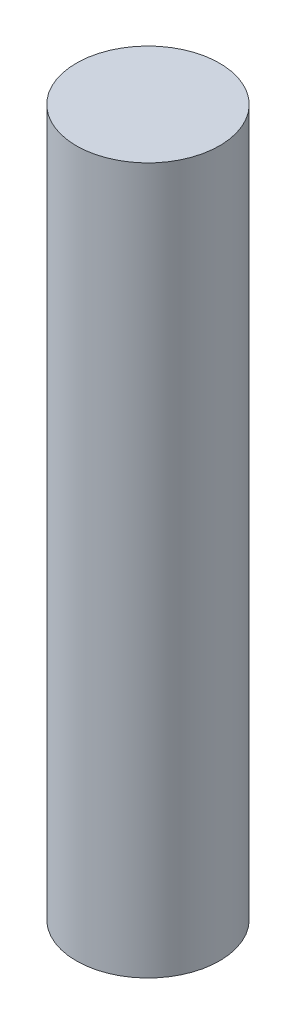
ISO-10303-21;
HEADER;
FILE_DESCRIPTION(('STEP AP214'),'2;1');
FILE_NAME('part.step','',(''),(''),'','','');
FILE_SCHEMA(('AUTOMOTIVE_DESIGN { 1 0 10303 214 1 1 1 1 }'));
ENDSEC;
DATA;
#1=APPLICATION_CONTEXT('core data for automotive mechanical design processes');
#2=APPLICATION_PROTOCOL_DEFINITION('international standard','automotive_design',2000,#1);
#3=PRODUCT_CONTEXT('',#1,'mechanical');
#4=PRODUCT('Part','Part','',(#3));
#5=PRODUCT_RELATED_PRODUCT_CATEGORY('part','',(#4));
#6=PRODUCT_DEFINITION_FORMATION('','',#4);
#7=PRODUCT_DEFINITION_CONTEXT('part definition',#1,'design');
#8=PRODUCT_DEFINITION('design','',#6,#7);
#9=PRODUCT_DEFINITION_SHAPE('','',#8);
#10=(LENGTH_UNIT() NAMED_UNIT(*) SI_UNIT(.MILLI.,.METRE.));
#11=(NAMED_UNIT(*) PLANE_ANGLE_UNIT() SI_UNIT($,.RADIAN.));
#12=(NAMED_UNIT(*) SI_UNIT($,.STERADIAN.) SOLID_ANGLE_UNIT());
#13=UNCERTAINTY_MEASURE_WITH_UNIT(LENGTH_MEASURE(1.E-05),#10,'distance_accuracy_value','');
#14=(GEOMETRIC_REPRESENTATION_CONTEXT(3) GLOBAL_UNCERTAINTY_ASSIGNED_CONTEXT((#13)) GLOBAL_UNIT_ASSIGNED_CONTEXT((#10,
#11,#12)) REPRESENTATION_CONTEXT('',''));
#15=CARTESIAN_POINT('',(0.,0.,0.));
#16=DIRECTION('',(0.,0.,1.));
#17=DIRECTION('',(1.,0.,0.));
#18=AXIS2_PLACEMENT_3D('',#15,#16,#17);
#19=CARTESIAN_POINT('',(0.,140.,0.));
#20=DIRECTION('',(0.,-1.,0.));
#21=DIRECTION('',(0.,0.,-1.));
#22=AXIS2_PLACEMENT_3D('',#19,#20,#21);
#23=CYLINDRICAL_SURFACE('',#22,14.2005724732833);
#24=CARTESIAN_POINT('',(0.,140.,0.));
#25=DIRECTION('',(0.,1.,0.));
#26=DIRECTION('',(0.,0.,1.));
#27=AXIS2_PLACEMENT_3D('',#24,#25,#26);
#28=CIRCLE('',#27,14.2005724732833);
#29=CARTESIAN_POINT('',(0.,140.,14.2005724732833));
#30=VERTEX_POINT('',#29);
#31=EDGE_CURVE('E10',#30,#30,#28,.T.);
#32=ORIENTED_EDGE('',*,*,#31,.F.);
#33=EDGE_LOOP('',(#32));
#34=FACE_BOUND('',#33,.T.);
#35=CARTESIAN_POINT('',(0.,0.,0.));
#36=DIRECTION('',(0.,1.,0.));
#37=DIRECTION('',(0.,0.,1.));
#38=AXIS2_PLACEMENT_3D('',#35,#36,#37);
#39=CIRCLE('',#38,14.2005724732833);
#40=CARTESIAN_POINT('',(0.,0.,14.2005724732833));
#41=VERTEX_POINT('',#40);
#42=EDGE_CURVE('E38',#41,#41,#39,.T.);
#43=ORIENTED_EDGE('',*,*,#42,.T.);
#44=EDGE_LOOP('',(#43));
#45=FACE_BOUND('',#44,.T.);
#46=ADVANCED_FACE('F35',(#34,#45),#23,.T.);
#47=CARTESIAN_POINT('',(0.,140.,0.));
#48=DIRECTION('',(0.,1.,0.));
#49=DIRECTION('',(0.,0.,1.));
#50=AXIS2_PLACEMENT_3D('',#47,#48,#49);
#51=PLANE('',#50);
#52=ORIENTED_EDGE('',*,*,#31,.T.);
#53=EDGE_LOOP('',(#52));
#54=FACE_BOUND('',#53,.T.);
#55=ADVANCED_FACE('F50',(#54),#51,.T.);
#56=CARTESIAN_POINT('',(0.,0.,0.));
#57=DIRECTION('',(0.,1.,0.));
#58=DIRECTION('',(0.,0.,1.));
#59=AXIS2_PLACEMENT_3D('',#56,#57,#58);
#60=PLANE('',#59);
#61=ORIENTED_EDGE('',*,*,#42,.F.);
#62=EDGE_LOOP('',(#61));
#63=FACE_BOUND('',#62,.T.);
#64=ADVANCED_FACE('F48',(#63),#60,.F.);
#65=CLOSED_SHELL('',(#46,#55,#64));
#66=MANIFOLD_SOLID_BREP('B2',#65);
#67=ADVANCED_BREP_SHAPE_REPRESENTATION('',(#18,#66),#14);
#68=SHAPE_DEFINITION_REPRESENTATION(#9,#67);
ENDSEC;
END-ISO-10303-21;
